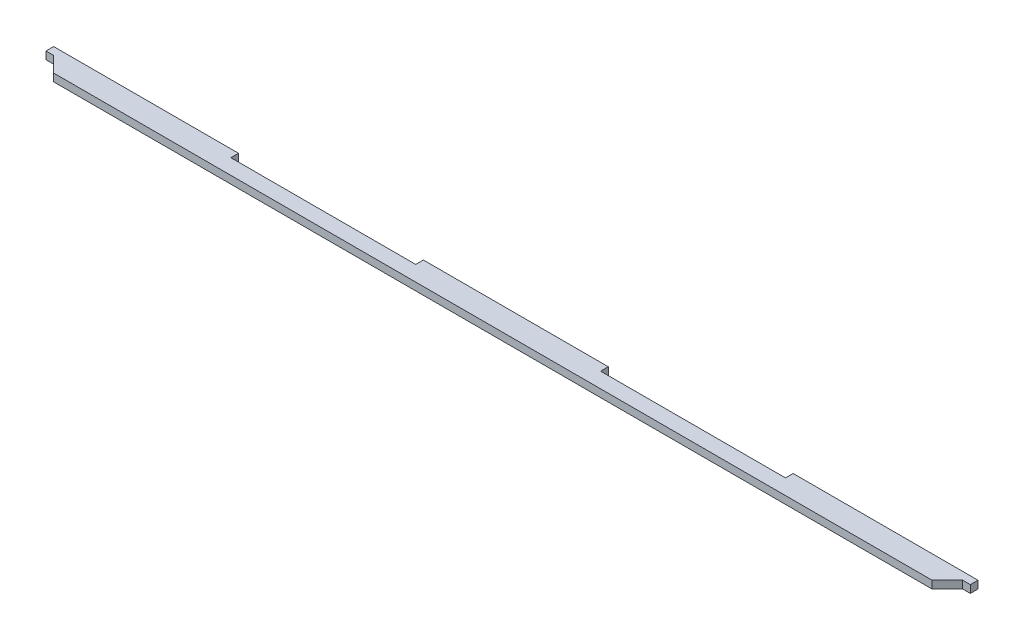
ISO-10303-21;
HEADER;
FILE_DESCRIPTION(('STEP AP214'),'2;1');
FILE_NAME('part.step','',(''),(''),'','','');
FILE_SCHEMA(('AUTOMOTIVE_DESIGN { 1 0 10303 214 1 1 1 1 }'));
ENDSEC;
DATA;
#1=APPLICATION_CONTEXT('core data for automotive mechanical design processes');
#2=APPLICATION_PROTOCOL_DEFINITION('international standard','automotive_design',2000,#1);
#3=PRODUCT_CONTEXT('',#1,'mechanical');
#4=PRODUCT('Part','Part','',(#3));
#5=PRODUCT_RELATED_PRODUCT_CATEGORY('part','',(#4));
#6=PRODUCT_DEFINITION_FORMATION('','',#4);
#7=PRODUCT_DEFINITION_CONTEXT('part definition',#1,'design');
#8=PRODUCT_DEFINITION('design','',#6,#7);
#9=PRODUCT_DEFINITION_SHAPE('','',#8);
#10=(LENGTH_UNIT() NAMED_UNIT(*) SI_UNIT(.MILLI.,.METRE.));
#11=(NAMED_UNIT(*) PLANE_ANGLE_UNIT() SI_UNIT($,.RADIAN.));
#12=(NAMED_UNIT(*) SI_UNIT($,.STERADIAN.) SOLID_ANGLE_UNIT());
#13=UNCERTAINTY_MEASURE_WITH_UNIT(LENGTH_MEASURE(1.E-05),#10,'distance_accuracy_value','');
#14=(GEOMETRIC_REPRESENTATION_CONTEXT(3) GLOBAL_UNCERTAINTY_ASSIGNED_CONTEXT((#13)) GLOBAL_UNIT_ASSIGNED_CONTEXT((#10,
#11,#12)) REPRESENTATION_CONTEXT('',''));
#15=CARTESIAN_POINT('',(0.,0.,0.));
#16=DIRECTION('',(0.,0.,1.));
#17=DIRECTION('',(1.,0.,0.));
#18=AXIS2_PLACEMENT_3D('',#15,#16,#17);
#19=CARTESIAN_POINT('',(-108.69,3.,-1.07887162492054));
#20=DIRECTION('',(0.,0.,1.));
#21=DIRECTION('',(1.,0.,0.));
#22=AXIS2_PLACEMENT_3D('',#19,#20,#21);
#23=PLANE('',#22);
#24=DIRECTION('',(-1.,0.,0.));
#25=VECTOR('',#24,1.);
#26=CARTESIAN_POINT('',(-108.69,0.,-1.07887162492054));
#27=LINE('',#26,#25);
#28=CARTESIAN_POINT('',(-36.23,0.,-1.07887162492054));
#29=VERTEX_POINT('',#28);
#30=CARTESIAN_POINT('',(-108.69,0.,-1.07887162492054));
#31=VERTEX_POINT('',#30);
#32=EDGE_CURVE('E176',#29,#31,#27,.T.);
#33=ORIENTED_EDGE('',*,*,#32,.T.);
#34=DIRECTION('',(0.,-1.,0.));
#35=VECTOR('',#34,1.);
#36=CARTESIAN_POINT('',(-108.69,3.,-1.07887162492054));
#37=LINE('',#36,#35);
#38=CARTESIAN_POINT('',(-108.69,3.,-1.07887162492054));
#39=VERTEX_POINT('',#38);
#40=EDGE_CURVE('E11',#39,#31,#37,.T.);
#41=ORIENTED_EDGE('',*,*,#40,.F.);
#42=DIRECTION('',(-1.,0.,0.));
#43=VECTOR('',#42,1.);
#44=CARTESIAN_POINT('',(-108.69,3.,-1.07887162492054));
#45=LINE('',#44,#43);
#46=CARTESIAN_POINT('',(-36.23,3.,-1.07887162492054));
#47=VERTEX_POINT('',#46);
#48=EDGE_CURVE('E206',#47,#39,#45,.T.);
#49=ORIENTED_EDGE('',*,*,#48,.F.);
#50=DIRECTION('',(0.,-1.,0.));
#51=VECTOR('',#50,1.);
#52=CARTESIAN_POINT('',(-36.23,3.,-1.07887162492054));
#53=LINE('',#52,#51);
#54=EDGE_CURVE('E172',#47,#29,#53,.T.);
#55=ORIENTED_EDGE('',*,*,#54,.T.);
#56=EDGE_LOOP('',(#33,#41,#49,#55));
#57=FACE_BOUND('',#56,.T.);
#58=ADVANCED_FACE('F32',(#57),#23,.F.);
#59=CARTESIAN_POINT('',(-108.69,3.,-4.07887162492054));
#60=DIRECTION('',(-1.,0.,0.));
#61=DIRECTION('',(0.,0.,1.));
#62=AXIS2_PLACEMENT_3D('',#59,#60,#61);
#63=PLANE('',#62);
#64=DIRECTION('',(0.,0.,-1.));
#65=VECTOR('',#64,1.);
#66=CARTESIAN_POINT('',(-108.69,0.,-4.07887162492054));
#67=LINE('',#66,#65);
#68=CARTESIAN_POINT('',(-108.69,0.,-4.07887162492054));
#69=VERTEX_POINT('',#68);
#70=EDGE_CURVE('E179',#31,#69,#67,.T.);
#71=ORIENTED_EDGE('',*,*,#70,.T.);
#72=DIRECTION('',(0.,-1.,0.));
#73=VECTOR('',#72,1.);
#74=CARTESIAN_POINT('',(-108.69,3.,-4.07887162492054));
#75=LINE('',#74,#73);
#76=CARTESIAN_POINT('',(-108.69,3.,-4.07887162492054));
#77=VERTEX_POINT('',#76);
#78=EDGE_CURVE('E40',#77,#69,#75,.T.);
#79=ORIENTED_EDGE('',*,*,#78,.F.);
#80=DIRECTION('',(0.,0.,-1.));
#81=VECTOR('',#80,1.);
#82=CARTESIAN_POINT('',(-108.69,3.,-4.07887162492054));
#83=LINE('',#82,#81);
#84=EDGE_CURVE('E115',#39,#77,#83,.T.);
#85=ORIENTED_EDGE('',*,*,#84,.F.);
#86=ORIENTED_EDGE('',*,*,#40,.T.);
#87=EDGE_LOOP('',(#71,#79,#85,#86));
#88=FACE_BOUND('',#87,.T.);
#89=ADVANCED_FACE('F304',(#88),#63,.F.);
#90=CARTESIAN_POINT('',(-181.15,3.,-4.07887162492054));
#91=DIRECTION('',(0.,0.,1.));
#92=DIRECTION('',(1.,0.,0.));
#93=AXIS2_PLACEMENT_3D('',#90,#91,#92);
#94=PLANE('',#93);
#95=DIRECTION('',(-1.,0.,0.));
#96=VECTOR('',#95,1.);
#97=CARTESIAN_POINT('',(-181.15,0.,-4.07887162492054));
#98=LINE('',#97,#96);
#99=CARTESIAN_POINT('',(-181.15,0.,-4.07887162492054));
#100=VERTEX_POINT('',#99);
#101=EDGE_CURVE('E181',#69,#100,#98,.T.);
#102=ORIENTED_EDGE('',*,*,#101,.T.);
#103=DIRECTION('',(0.,-1.,0.));
#104=VECTOR('',#103,1.);
#105=CARTESIAN_POINT('',(-181.15,3.,-4.07887162492054));
#106=LINE('',#105,#104);
#107=CARTESIAN_POINT('',(-181.15,3.,-4.07887162492054));
#108=VERTEX_POINT('',#107);
#109=EDGE_CURVE('E237',#108,#100,#106,.T.);
#110=ORIENTED_EDGE('',*,*,#109,.F.);
#111=DIRECTION('',(-1.,0.,0.));
#112=VECTOR('',#111,1.);
#113=CARTESIAN_POINT('',(-181.15,3.,-4.07887162492054));
#114=LINE('',#113,#112);
#115=EDGE_CURVE('E245',#77,#108,#114,.T.);
#116=ORIENTED_EDGE('',*,*,#115,.F.);
#117=ORIENTED_EDGE('',*,*,#78,.T.);
#118=EDGE_LOOP('',(#102,#110,#116,#117));
#119=FACE_BOUND('',#118,.T.);
#120=ADVANCED_FACE('F243',(#119),#94,.F.);
#121=CARTESIAN_POINT('',(-181.15,3.,-4.07887162492054));
#122=DIRECTION('',(1.,0.,0.));
#123=DIRECTION('',(0.,0.,-1.));
#124=AXIS2_PLACEMENT_3D('',#121,#122,#123);
#125=PLANE('',#124);
#126=DIRECTION('',(0.,0.,1.));
#127=VECTOR('',#126,1.);
#128=CARTESIAN_POINT('',(-181.15,0.,-4.07887162492054));
#129=LINE('',#128,#127);
#130=CARTESIAN_POINT('',(-181.15,0.,-1.07887162492054));
#131=VERTEX_POINT('',#130);
#132=EDGE_CURVE('E183',#100,#131,#129,.T.);
#133=ORIENTED_EDGE('',*,*,#132,.T.);
#134=DIRECTION('',(0.,-1.,0.));
#135=VECTOR('',#134,1.);
#136=CARTESIAN_POINT('',(-181.15,3.,-1.07887162492054));
#137=LINE('',#136,#135);
#138=CARTESIAN_POINT('',(-181.15,3.,-1.07887162492054));
#139=VERTEX_POINT('',#138);
#140=EDGE_CURVE('E234',#139,#131,#137,.T.);
#141=ORIENTED_EDGE('',*,*,#140,.F.);
#142=DIRECTION('',(0.,0.,1.));
#143=VECTOR('',#142,1.);
#144=CARTESIAN_POINT('',(-181.15,3.,-4.07887162492054));
#145=LINE('',#144,#143);
#146=EDGE_CURVE('E263',#108,#139,#145,.T.);
#147=ORIENTED_EDGE('',*,*,#146,.F.);
#148=ORIENTED_EDGE('',*,*,#109,.T.);
#149=EDGE_LOOP('',(#133,#141,#147,#148));
#150=FACE_BOUND('',#149,.T.);
#151=ADVANCED_FACE('F254',(#150),#125,.F.);
#152=CARTESIAN_POINT('',(-181.15,3.,-1.07887162492054));
#153=DIRECTION('',(0.,0.,-1.));
#154=DIRECTION('',(-1.,0.,0.));
#155=AXIS2_PLACEMENT_3D('',#152,#153,#154);
#156=PLANE('',#155);
#157=DIRECTION('',(1.,0.,0.));
#158=VECTOR('',#157,1.);
#159=CARTESIAN_POINT('',(-181.15,0.,-1.07887162492054));
#160=LINE('',#159,#158);
#161=CARTESIAN_POINT('',(-178.15,0.,-1.07887162492054));
#162=VERTEX_POINT('',#161);
#163=EDGE_CURVE('E185',#131,#162,#160,.T.);
#164=ORIENTED_EDGE('',*,*,#163,.T.);
#165=DIRECTION('',(0.,-1.,0.));
#166=VECTOR('',#165,1.);
#167=CARTESIAN_POINT('',(-178.15,3.,-1.07887162492054));
#168=LINE('',#167,#166);
#169=CARTESIAN_POINT('',(-178.15,3.,-1.07887162492054));
#170=VERTEX_POINT('',#169);
#171=EDGE_CURVE('E231',#170,#162,#168,.T.);
#172=ORIENTED_EDGE('',*,*,#171,.F.);
#173=DIRECTION('',(1.,0.,0.));
#174=VECTOR('',#173,1.);
#175=CARTESIAN_POINT('',(-181.15,3.,-1.07887162492054));
#176=LINE('',#175,#174);
#177=EDGE_CURVE('E260',#139,#170,#176,.T.);
#178=ORIENTED_EDGE('',*,*,#177,.F.);
#179=ORIENTED_EDGE('',*,*,#140,.T.);
#180=EDGE_LOOP('',(#164,#172,#178,#179));
#181=FACE_BOUND('',#180,.T.);
#182=ADVANCED_FACE('F258',(#181),#156,.F.);
#183=CARTESIAN_POINT('',(-178.15,3.,-1.07887162492054));
#184=DIRECTION('',(0.707106781186539,0.,-0.707106781186556));
#185=DIRECTION('',(-0.707106781186556,0.,-0.707106781186539));
#186=AXIS2_PLACEMENT_3D('',#183,#184,#185);
#187=PLANE('',#186);
#188=DIRECTION('',(0.707106781186556,0.,0.707106781186539));
#189=VECTOR('',#188,1.);
#190=CARTESIAN_POINT('',(-178.15,0.,-1.07887162492054));
#191=LINE('',#190,#189);
#192=CARTESIAN_POINT('',(-172.15,0.,4.92112837507946));
#193=VERTEX_POINT('',#192);
#194=EDGE_CURVE('E187',#162,#193,#191,.T.);
#195=ORIENTED_EDGE('',*,*,#194,.T.);
#196=DIRECTION('',(0.,-1.,0.));
#197=VECTOR('',#196,1.);
#198=CARTESIAN_POINT('',(-172.15,3.,4.92112837507946));
#199=LINE('',#198,#197);
#200=CARTESIAN_POINT('',(-172.15,3.,4.92112837507946));
#201=VERTEX_POINT('',#200);
#202=EDGE_CURVE('E228',#201,#193,#199,.T.);
#203=ORIENTED_EDGE('',*,*,#202,.F.);
#204=DIRECTION('',(0.707106781186556,0.,0.707106781186539));
#205=VECTOR('',#204,1.);
#206=CARTESIAN_POINT('',(-178.15,3.,-1.07887162492054));
#207=LINE('',#206,#205);
#208=EDGE_CURVE('E262',#170,#201,#207,.T.);
#209=ORIENTED_EDGE('',*,*,#208,.F.);
#210=ORIENTED_EDGE('',*,*,#171,.T.);
#211=EDGE_LOOP('',(#195,#203,#209,#210));
#212=FACE_BOUND('',#211,.T.);
#213=ADVANCED_FACE('F317',(#212),#187,.F.);
#214=CARTESIAN_POINT('',(-172.15,3.,4.92112837507946));
#215=DIRECTION('',(0.,0.,-1.));
#216=DIRECTION('',(-1.,0.,0.));
#217=AXIS2_PLACEMENT_3D('',#214,#215,#216);
#218=PLANE('',#217);
#219=DIRECTION('',(1.,0.,0.));
#220=VECTOR('',#219,1.);
#221=CARTESIAN_POINT('',(-172.15,0.,4.92112837507946));
#222=LINE('',#221,#220);
#223=CARTESIAN_POINT('',(172.15,0.,4.92112837507946));
#224=VERTEX_POINT('',#223);
#225=EDGE_CURVE('E189',#193,#224,#222,.T.);
#226=ORIENTED_EDGE('',*,*,#225,.T.);
#227=DIRECTION('',(0.,-1.,0.));
#228=VECTOR('',#227,1.);
#229=CARTESIAN_POINT('',(172.15,3.,4.92112837507946));
#230=LINE('',#229,#228);
#231=CARTESIAN_POINT('',(172.15,3.,4.92112837507946));
#232=VERTEX_POINT('',#231);
#233=EDGE_CURVE('E225',#232,#224,#230,.T.);
#234=ORIENTED_EDGE('',*,*,#233,.F.);
#235=DIRECTION('',(1.,0.,0.));
#236=VECTOR('',#235,1.);
#237=CARTESIAN_POINT('',(-172.15,3.,4.92112837507946));
#238=LINE('',#237,#236);
#239=EDGE_CURVE('E265',#201,#232,#238,.T.);
#240=ORIENTED_EDGE('',*,*,#239,.F.);
#241=ORIENTED_EDGE('',*,*,#202,.T.);
#242=EDGE_LOOP('',(#226,#234,#240,#241));
#243=FACE_BOUND('',#242,.T.);
#244=ADVANCED_FACE('F320',(#243),#218,.F.);
#245=CARTESIAN_POINT('',(178.15,3.,-1.07887162492054));
#246=DIRECTION('',(-0.707106781186554,0.,-0.707106781186541));
#247=DIRECTION('',(-0.707106781186541,0.,0.707106781186554));
#248=AXIS2_PLACEMENT_3D('',#245,#246,#247);
#249=PLANE('',#248);
#250=DIRECTION('',(0.707106781186541,0.,-0.707106781186554));
#251=VECTOR('',#250,1.);
#252=CARTESIAN_POINT('',(178.15,0.,-1.07887162492054));
#253=LINE('',#252,#251);
#254=CARTESIAN_POINT('',(178.15,0.,-1.07887162492054));
#255=VERTEX_POINT('',#254);
#256=EDGE_CURVE('E191',#224,#255,#253,.T.);
#257=ORIENTED_EDGE('',*,*,#256,.T.);
#258=DIRECTION('',(0.,-1.,0.));
#259=VECTOR('',#258,1.);
#260=CARTESIAN_POINT('',(178.15,3.,-1.07887162492054));
#261=LINE('',#260,#259);
#262=CARTESIAN_POINT('',(178.15,3.,-1.07887162492054));
#263=VERTEX_POINT('',#262);
#264=EDGE_CURVE('E222',#263,#255,#261,.T.);
#265=ORIENTED_EDGE('',*,*,#264,.F.);
#266=DIRECTION('',(0.707106781186541,0.,-0.707106781186554));
#267=VECTOR('',#266,1.);
#268=CARTESIAN_POINT('',(178.15,3.,-1.07887162492054));
#269=LINE('',#268,#267);
#270=EDGE_CURVE('E271',#232,#263,#269,.T.);
#271=ORIENTED_EDGE('',*,*,#270,.F.);
#272=ORIENTED_EDGE('',*,*,#233,.T.);
#273=EDGE_LOOP('',(#257,#265,#271,#272));
#274=FACE_BOUND('',#273,.T.);
#275=ADVANCED_FACE('F324',(#274),#249,.F.);
#276=CARTESIAN_POINT('',(178.15,3.,-1.07887162492054));
#277=DIRECTION('',(0.,0.,-1.));
#278=DIRECTION('',(-1.,0.,0.));
#279=AXIS2_PLACEMENT_3D('',#276,#277,#278);
#280=PLANE('',#279);
#281=DIRECTION('',(1.,0.,0.));
#282=VECTOR('',#281,1.);
#283=CARTESIAN_POINT('',(178.15,0.,-1.07887162492054));
#284=LINE('',#283,#282);
#285=CARTESIAN_POINT('',(181.15,0.,-1.07887162492054));
#286=VERTEX_POINT('',#285);
#287=EDGE_CURVE('E193',#255,#286,#284,.T.);
#288=ORIENTED_EDGE('',*,*,#287,.T.);
#289=DIRECTION('',(0.,-1.,0.));
#290=VECTOR('',#289,1.);
#291=CARTESIAN_POINT('',(181.15,3.,-1.07887162492054));
#292=LINE('',#291,#290);
#293=CARTESIAN_POINT('',(181.15,3.,-1.07887162492054));
#294=VERTEX_POINT('',#293);
#295=EDGE_CURVE('E219',#294,#286,#292,.T.);
#296=ORIENTED_EDGE('',*,*,#295,.F.);
#297=DIRECTION('',(1.,0.,0.));
#298=VECTOR('',#297,1.);
#299=CARTESIAN_POINT('',(178.15,3.,-1.07887162492054));
#300=LINE('',#299,#298);
#301=EDGE_CURVE('E273',#263,#294,#300,.T.);
#302=ORIENTED_EDGE('',*,*,#301,.F.);
#303=ORIENTED_EDGE('',*,*,#264,.T.);
#304=EDGE_LOOP('',(#288,#296,#302,#303));
#305=FACE_BOUND('',#304,.T.);
#306=ADVANCED_FACE('F328',(#305),#280,.F.);
#307=CARTESIAN_POINT('',(181.15,3.,-4.07887162492054));
#308=DIRECTION('',(-1.,0.,0.));
#309=DIRECTION('',(0.,0.,1.));
#310=AXIS2_PLACEMENT_3D('',#307,#308,#309);
#311=PLANE('',#310);
#312=DIRECTION('',(0.,0.,-1.));
#313=VECTOR('',#312,1.);
#314=CARTESIAN_POINT('',(181.15,0.,-4.07887162492054));
#315=LINE('',#314,#313);
#316=CARTESIAN_POINT('',(181.15,0.,-4.07887162492054));
#317=VERTEX_POINT('',#316);
#318=EDGE_CURVE('E195',#286,#317,#315,.T.);
#319=ORIENTED_EDGE('',*,*,#318,.T.);
#320=DIRECTION('',(0.,-1.,0.));
#321=VECTOR('',#320,1.);
#322=CARTESIAN_POINT('',(181.15,3.,-4.07887162492054));
#323=LINE('',#322,#321);
#324=CARTESIAN_POINT('',(181.15,3.,-4.07887162492054));
#325=VERTEX_POINT('',#324);
#326=EDGE_CURVE('E216',#325,#317,#323,.T.);
#327=ORIENTED_EDGE('',*,*,#326,.F.);
#328=DIRECTION('',(0.,0.,-1.));
#329=VECTOR('',#328,1.);
#330=CARTESIAN_POINT('',(181.15,3.,-4.07887162492054));
#331=LINE('',#330,#329);
#332=EDGE_CURVE('E275',#294,#325,#331,.T.);
#333=ORIENTED_EDGE('',*,*,#332,.F.);
#334=ORIENTED_EDGE('',*,*,#295,.T.);
#335=EDGE_LOOP('',(#319,#327,#333,#334));
#336=FACE_BOUND('',#335,.T.);
#337=ADVANCED_FACE('F332',(#336),#311,.F.);
#338=CARTESIAN_POINT('',(108.69,3.,-4.07887162492054));
#339=DIRECTION('',(0.,0.,1.));
#340=DIRECTION('',(1.,0.,0.));
#341=AXIS2_PLACEMENT_3D('',#338,#339,#340);
#342=PLANE('',#341);
#343=DIRECTION('',(-1.,0.,0.));
#344=VECTOR('',#343,1.);
#345=CARTESIAN_POINT('',(108.69,0.,-4.07887162492054));
#346=LINE('',#345,#344);
#347=CARTESIAN_POINT('',(108.69,0.,-4.07887162492054));
#348=VERTEX_POINT('',#347);
#349=EDGE_CURVE('E197',#317,#348,#346,.T.);
#350=ORIENTED_EDGE('',*,*,#349,.T.);
#351=DIRECTION('',(0.,-1.,0.));
#352=VECTOR('',#351,1.);
#353=CARTESIAN_POINT('',(108.69,3.,-4.07887162492054));
#354=LINE('',#353,#352);
#355=CARTESIAN_POINT('',(108.69,3.,-4.07887162492054));
#356=VERTEX_POINT('',#355);
#357=EDGE_CURVE('E213',#356,#348,#354,.T.);
#358=ORIENTED_EDGE('',*,*,#357,.F.);
#359=DIRECTION('',(-1.,0.,0.));
#360=VECTOR('',#359,1.);
#361=CARTESIAN_POINT('',(108.69,3.,-4.07887162492054));
#362=LINE('',#361,#360);
#363=EDGE_CURVE('E277',#325,#356,#362,.T.);
#364=ORIENTED_EDGE('',*,*,#363,.F.);
#365=ORIENTED_EDGE('',*,*,#326,.T.);
#366=EDGE_LOOP('',(#350,#358,#364,#365));
#367=FACE_BOUND('',#366,.T.);
#368=ADVANCED_FACE('F336',(#367),#342,.F.);
#369=CARTESIAN_POINT('',(108.69,3.,-4.07887162492054));
#370=DIRECTION('',(1.,0.,0.));
#371=DIRECTION('',(0.,0.,-1.));
#372=AXIS2_PLACEMENT_3D('',#369,#370,#371);
#373=PLANE('',#372);
#374=DIRECTION('',(0.,0.,1.));
#375=VECTOR('',#374,1.);
#376=CARTESIAN_POINT('',(108.69,0.,-4.07887162492054));
#377=LINE('',#376,#375);
#378=CARTESIAN_POINT('',(108.69,0.,-1.07887162492054));
#379=VERTEX_POINT('',#378);
#380=EDGE_CURVE('E199',#348,#379,#377,.T.);
#381=ORIENTED_EDGE('',*,*,#380,.T.);
#382=DIRECTION('',(0.,-1.,0.));
#383=VECTOR('',#382,1.);
#384=CARTESIAN_POINT('',(108.69,3.,-1.07887162492054));
#385=LINE('',#384,#383);
#386=CARTESIAN_POINT('',(108.69,3.,-1.07887162492054));
#387=VERTEX_POINT('',#386);
#388=EDGE_CURVE('E210',#387,#379,#385,.T.);
#389=ORIENTED_EDGE('',*,*,#388,.F.);
#390=DIRECTION('',(0.,0.,1.));
#391=VECTOR('',#390,1.);
#392=CARTESIAN_POINT('',(108.69,3.,-4.07887162492054));
#393=LINE('',#392,#391);
#394=EDGE_CURVE('E279',#356,#387,#393,.T.);
#395=ORIENTED_EDGE('',*,*,#394,.F.);
#396=ORIENTED_EDGE('',*,*,#357,.T.);
#397=EDGE_LOOP('',(#381,#389,#395,#396));
#398=FACE_BOUND('',#397,.T.);
#399=ADVANCED_FACE('F285',(#398),#373,.F.);
#400=CARTESIAN_POINT('',(36.23,3.,-1.07887162492054));
#401=DIRECTION('',(0.,0.,1.));
#402=DIRECTION('',(1.,0.,0.));
#403=AXIS2_PLACEMENT_3D('',#400,#401,#402);
#404=PLANE('',#403);
#405=DIRECTION('',(-1.,0.,0.));
#406=VECTOR('',#405,1.);
#407=CARTESIAN_POINT('',(36.23,0.,-1.07887162492054));
#408=LINE('',#407,#406);
#409=CARTESIAN_POINT('',(36.23,0.,-1.07887162492054));
#410=VERTEX_POINT('',#409);
#411=EDGE_CURVE('E201',#379,#410,#408,.T.);
#412=ORIENTED_EDGE('',*,*,#411,.T.);
#413=DIRECTION('',(0.,-1.,0.));
#414=VECTOR('',#413,1.);
#415=CARTESIAN_POINT('',(36.23,3.,-1.07887162492054));
#416=LINE('',#415,#414);
#417=CARTESIAN_POINT('',(36.23,3.,-1.07887162492054));
#418=VERTEX_POINT('',#417);
#419=EDGE_CURVE('E167',#418,#410,#416,.T.);
#420=ORIENTED_EDGE('',*,*,#419,.F.);
#421=DIRECTION('',(-1.,0.,0.));
#422=VECTOR('',#421,1.);
#423=CARTESIAN_POINT('',(36.23,3.,-1.07887162492054));
#424=LINE('',#423,#422);
#425=EDGE_CURVE('E158',#387,#418,#424,.T.);
#426=ORIENTED_EDGE('',*,*,#425,.F.);
#427=ORIENTED_EDGE('',*,*,#388,.T.);
#428=EDGE_LOOP('',(#412,#420,#426,#427));
#429=FACE_BOUND('',#428,.T.);
#430=ADVANCED_FACE('F289',(#429),#404,.F.);
#431=CARTESIAN_POINT('',(36.23,3.,-4.07887162492054));
#432=DIRECTION('',(-1.,0.,0.));
#433=DIRECTION('',(0.,0.,1.));
#434=AXIS2_PLACEMENT_3D('',#431,#432,#433);
#435=PLANE('',#434);
#436=DIRECTION('',(0.,0.,-1.));
#437=VECTOR('',#436,1.);
#438=CARTESIAN_POINT('',(36.23,0.,-4.07887162492054));
#439=LINE('',#438,#437);
#440=CARTESIAN_POINT('',(36.23,0.,-4.07887162492054));
#441=VERTEX_POINT('',#440);
#442=EDGE_CURVE('E166',#410,#441,#439,.T.);
#443=ORIENTED_EDGE('',*,*,#442,.T.);
#444=DIRECTION('',(0.,-1.,0.));
#445=VECTOR('',#444,1.);
#446=CARTESIAN_POINT('',(36.23,3.,-4.07887162492054));
#447=LINE('',#446,#445);
#448=CARTESIAN_POINT('',(36.23,3.,-4.07887162492054));
#449=VERTEX_POINT('',#448);
#450=EDGE_CURVE('E163',#449,#441,#447,.T.);
#451=ORIENTED_EDGE('',*,*,#450,.F.);
#452=DIRECTION('',(0.,0.,-1.));
#453=VECTOR('',#452,1.);
#454=CARTESIAN_POINT('',(36.23,3.,-4.07887162492054));
#455=LINE('',#454,#453);
#456=EDGE_CURVE('E152',#418,#449,#455,.T.);
#457=ORIENTED_EDGE('',*,*,#456,.F.);
#458=ORIENTED_EDGE('',*,*,#419,.T.);
#459=EDGE_LOOP('',(#443,#451,#457,#458));
#460=FACE_BOUND('',#459,.T.);
#461=ADVANCED_FACE('F164',(#460),#435,.F.);
#462=CARTESIAN_POINT('',(-36.23,3.,-4.07887162492054));
#463=DIRECTION('',(0.,0.,1.));
#464=DIRECTION('',(1.,0.,0.));
#465=AXIS2_PLACEMENT_3D('',#462,#463,#464);
#466=PLANE('',#465);
#467=DIRECTION('',(-1.,0.,0.));
#468=VECTOR('',#467,1.);
#469=CARTESIAN_POINT('',(-36.23,0.,-4.07887162492054));
#470=LINE('',#469,#468);
#471=CARTESIAN_POINT('',(-36.23,0.,-4.07887162492054));
#472=VERTEX_POINT('',#471);
#473=EDGE_CURVE('E101',#441,#472,#470,.T.);
#474=ORIENTED_EDGE('',*,*,#473,.T.);
#475=DIRECTION('',(0.,-1.,0.));
#476=VECTOR('',#475,1.);
#477=CARTESIAN_POINT('',(-36.23,3.,-4.07887162492054));
#478=LINE('',#477,#476);
#479=CARTESIAN_POINT('',(-36.23,3.,-4.07887162492054));
#480=VERTEX_POINT('',#479);
#481=EDGE_CURVE('E168',#480,#472,#478,.T.);
#482=ORIENTED_EDGE('',*,*,#481,.F.);
#483=DIRECTION('',(-1.,0.,0.));
#484=VECTOR('',#483,1.);
#485=CARTESIAN_POINT('',(-36.23,3.,-4.07887162492054));
#486=LINE('',#485,#484);
#487=EDGE_CURVE('E156',#449,#480,#486,.T.);
#488=ORIENTED_EDGE('',*,*,#487,.F.);
#489=ORIENTED_EDGE('',*,*,#450,.T.);
#490=EDGE_LOOP('',(#474,#482,#488,#489));
#491=FACE_BOUND('',#490,.T.);
#492=ADVANCED_FACE('F170',(#491),#466,.F.);
#493=CARTESIAN_POINT('',(-36.23,3.,-4.07887162492054));
#494=DIRECTION('',(1.,0.,0.));
#495=DIRECTION('',(0.,0.,-1.));
#496=AXIS2_PLACEMENT_3D('',#493,#494,#495);
#497=PLANE('',#496);
#498=DIRECTION('',(0.,0.,1.));
#499=VECTOR('',#498,1.);
#500=CARTESIAN_POINT('',(-36.23,0.,-4.07887162492054));
#501=LINE('',#500,#499);
#502=EDGE_CURVE('E107',#472,#29,#501,.T.);
#503=ORIENTED_EDGE('',*,*,#502,.T.);
#504=ORIENTED_EDGE('',*,*,#54,.F.);
#505=DIRECTION('',(0.,0.,1.));
#506=VECTOR('',#505,1.);
#507=CARTESIAN_POINT('',(-36.23,3.,-4.07887162492054));
#508=LINE('',#507,#506);
#509=EDGE_CURVE('E48',#480,#47,#508,.T.);
#510=ORIENTED_EDGE('',*,*,#509,.F.);
#511=ORIENTED_EDGE('',*,*,#481,.T.);
#512=EDGE_LOOP('',(#503,#504,#510,#511));
#513=FACE_BOUND('',#512,.T.);
#514=ADVANCED_FACE('F293',(#513),#497,.F.);
#515=CARTESIAN_POINT('',(0.,3.,0.));
#516=DIRECTION('',(0.,-1.,0.));
#517=DIRECTION('',(0.,0.,-1.));
#518=AXIS2_PLACEMENT_3D('',#515,#516,#517);
#519=PLANE('',#518);
#520=ORIENTED_EDGE('',*,*,#48,.T.);
#521=ORIENTED_EDGE('',*,*,#84,.T.);
#522=ORIENTED_EDGE('',*,*,#115,.T.);
#523=ORIENTED_EDGE('',*,*,#146,.T.);
#524=ORIENTED_EDGE('',*,*,#177,.T.);
#525=ORIENTED_EDGE('',*,*,#208,.T.);
#526=ORIENTED_EDGE('',*,*,#239,.T.);
#527=ORIENTED_EDGE('',*,*,#270,.T.);
#528=ORIENTED_EDGE('',*,*,#301,.T.);
#529=ORIENTED_EDGE('',*,*,#332,.T.);
#530=ORIENTED_EDGE('',*,*,#363,.T.);
#531=ORIENTED_EDGE('',*,*,#394,.T.);
#532=ORIENTED_EDGE('',*,*,#425,.T.);
#533=ORIENTED_EDGE('',*,*,#456,.T.);
#534=ORIENTED_EDGE('',*,*,#487,.T.);
#535=ORIENTED_EDGE('',*,*,#509,.T.);
#536=EDGE_LOOP('',(#520,#521,#522,#523,#524,#525,#526,#527,#528,#529,#530,#531,#532,#533,#534,#535));
#537=FACE_BOUND('',#536,.T.);
#538=ADVANCED_FACE('F154',(#537),#519,.F.);
#539=CARTESIAN_POINT('',(0.,0.,0.));
#540=DIRECTION('',(0.,-1.,0.));
#541=DIRECTION('',(0.,0.,-1.));
#542=AXIS2_PLACEMENT_3D('',#539,#540,#541);
#543=PLANE('',#542);
#544=ORIENTED_EDGE('',*,*,#32,.F.);
#545=ORIENTED_EDGE('',*,*,#502,.F.);
#546=ORIENTED_EDGE('',*,*,#473,.F.);
#547=ORIENTED_EDGE('',*,*,#442,.F.);
#548=ORIENTED_EDGE('',*,*,#411,.F.);
#549=ORIENTED_EDGE('',*,*,#380,.F.);
#550=ORIENTED_EDGE('',*,*,#349,.F.);
#551=ORIENTED_EDGE('',*,*,#318,.F.);
#552=ORIENTED_EDGE('',*,*,#287,.F.);
#553=ORIENTED_EDGE('',*,*,#256,.F.);
#554=ORIENTED_EDGE('',*,*,#225,.F.);
#555=ORIENTED_EDGE('',*,*,#194,.F.);
#556=ORIENTED_EDGE('',*,*,#163,.F.);
#557=ORIENTED_EDGE('',*,*,#132,.F.);
#558=ORIENTED_EDGE('',*,*,#101,.F.);
#559=ORIENTED_EDGE('',*,*,#70,.F.);
#560=EDGE_LOOP('',(#544,#545,#546,#547,#548,#549,#550,#551,#552,#553,#554,#555,#556,#557,#558,#559));
#561=FACE_BOUND('',#560,.T.);
#562=ADVANCED_FACE('F249',(#561),#543,.T.);
#563=CLOSED_SHELL('',(#58,#89,#120,#151,#182,#213,#244,#275,#306,#337,#368,#399,#430,#461,#492,
#514,#538,#562));
#564=MANIFOLD_SOLID_BREP('B2',#563);
#565=ADVANCED_BREP_SHAPE_REPRESENTATION('',(#18,#564),#14);
#566=SHAPE_DEFINITION_REPRESENTATION(#9,#565);
ENDSEC;
END-ISO-10303-21;
